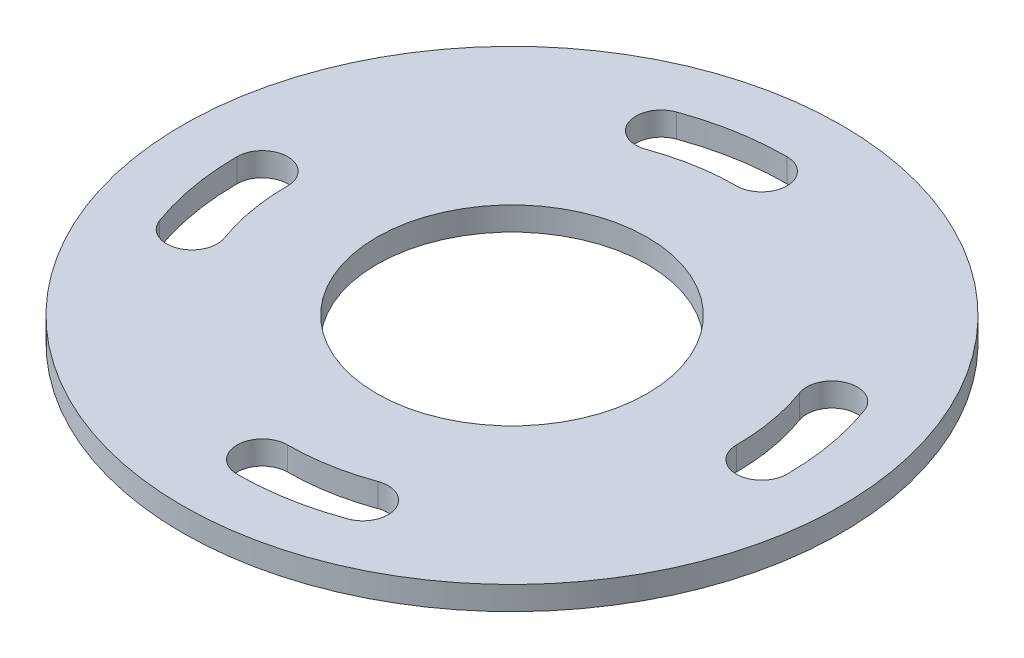
ISO-10303-21;
HEADER;
FILE_DESCRIPTION(('STEP AP214'),'2;1');
FILE_NAME('part.step','',(''),(''),'','','');
FILE_SCHEMA(('AUTOMOTIVE_DESIGN { 1 0 10303 214 1 1 1 1 }'));
ENDSEC;
DATA;
#1=APPLICATION_CONTEXT('core data for automotive mechanical design processes');
#2=APPLICATION_PROTOCOL_DEFINITION('international standard','automotive_design',2000,#1);
#3=PRODUCT_CONTEXT('',#1,'mechanical');
#4=PRODUCT('Part','Part','',(#3));
#5=PRODUCT_RELATED_PRODUCT_CATEGORY('part','',(#4));
#6=PRODUCT_DEFINITION_FORMATION('','',#4);
#7=PRODUCT_DEFINITION_CONTEXT('part definition',#1,'design');
#8=PRODUCT_DEFINITION('design','',#6,#7);
#9=PRODUCT_DEFINITION_SHAPE('','',#8);
#10=(LENGTH_UNIT() NAMED_UNIT(*) SI_UNIT(.MILLI.,.METRE.));
#11=(NAMED_UNIT(*) PLANE_ANGLE_UNIT() SI_UNIT($,.RADIAN.));
#12=(NAMED_UNIT(*) SI_UNIT($,.STERADIAN.) SOLID_ANGLE_UNIT());
#13=UNCERTAINTY_MEASURE_WITH_UNIT(LENGTH_MEASURE(1.E-05),#10,'distance_accuracy_value','');
#14=(GEOMETRIC_REPRESENTATION_CONTEXT(3) GLOBAL_UNCERTAINTY_ASSIGNED_CONTEXT((#13)) GLOBAL_UNIT_ASSIGNED_CONTEXT((#10,
#11,#12)) REPRESENTATION_CONTEXT('',''));
#15=CARTESIAN_POINT('',(0.,0.,0.));
#16=DIRECTION('',(0.,0.,1.));
#17=DIRECTION('',(1.,0.,0.));
#18=AXIS2_PLACEMENT_3D('',#15,#16,#17);
#19=CARTESIAN_POINT('',(0.,2.,0.));
#20=DIRECTION('',(0.,1.,0.));
#21=DIRECTION('',(0.,0.,1.));
#22=AXIS2_PLACEMENT_3D('',#19,#20,#21);
#23=PLANE('',#22);
#24=CARTESIAN_POINT('',(0.,2.,0.));
#25=DIRECTION('',(0.,1.,0.));
#26=DIRECTION('',(-1.,0.,0.));
#27=AXIS2_PLACEMENT_3D('',#24,#25,#26);
#28=CIRCLE('',#27,23.3632034355964);
#29=CARTESIAN_POINT('',(2.44584916902034E-13,2.,23.3632034355964));
#30=VERTEX_POINT('',#29);
#31=CARTESIAN_POINT('',(7.99068618758972,2.,21.9542298663498));
#32=VERTEX_POINT('',#31);
#33=EDGE_CURVE('E47',#30,#32,#28,.T.);
#34=ORIENTED_EDGE('',*,*,#33,.F.);
#35=CARTESIAN_POINT('',(2.22196511797404E-13,2.,21.2132034355964));
#36=DIRECTION('',(0.,1.,0.));
#37=DIRECTION('',(-1.,0.,0.));
#38=AXIS2_PLACEMENT_3D('',#35,#36,#37);
#39=CIRCLE('',#38,2.15);
#40=CARTESIAN_POINT('',(2.00071405754591E-13,2.,19.0632034355964));
#41=VERTEX_POINT('',#40);
#42=EDGE_CURVE('E163',#41,#30,#39,.T.);
#43=ORIENTED_EDGE('',*,*,#42,.F.);
#44=CARTESIAN_POINT('',(0.,2.,0.));
#45=DIRECTION('',(0.,-1.,0.));
#46=DIRECTION('',(-1.,0.,0.));
#47=AXIS2_PLACEMENT_3D('',#44,#45,#46);
#48=CIRCLE('',#47,19.0632034355964);
#49=CARTESIAN_POINT('',(6.5199995712893,2.,17.9135515969705));
#50=VERTEX_POINT('',#49);
#51=EDGE_CURVE('E166',#50,#41,#48,.T.);
#52=ORIENTED_EDGE('',*,*,#51,.F.);
#53=CARTESIAN_POINT('',(7.25534287943951,2.,19.9338907316602));
#54=DIRECTION('',(0.,1.,0.));
#55=DIRECTION('',(-1.,0.,0.));
#56=AXIS2_PLACEMENT_3D('',#53,#54,#55);
#57=CIRCLE('',#56,2.15);
#58=EDGE_CURVE('E172',#32,#50,#57,.T.);
#59=ORIENTED_EDGE('',*,*,#58,.F.);
#60=EDGE_LOOP('',(#34,#43,#52,#59));
#61=FACE_BOUND('',#60,.T.);
#62=CARTESIAN_POINT('',(0.,2.,0.));
#63=DIRECTION('',(0.,1.,0.));
#64=DIRECTION('',(0.,0.,-1.));
#65=AXIS2_PLACEMENT_3D('',#62,#63,#64);
#66=CIRCLE('',#65,23.3632034355964);
#67=CARTESIAN_POINT('',(-23.3632034355964,2.,0.));
#68=VERTEX_POINT('',#67);
#69=CARTESIAN_POINT('',(-21.9542298663499,2.,7.99068618758949));
#70=VERTEX_POINT('',#69);
#71=EDGE_CURVE('E178',#68,#70,#66,.T.);
#72=ORIENTED_EDGE('',*,*,#71,.F.);
#73=CARTESIAN_POINT('',(-21.2132034355964,2.,0.));
#74=DIRECTION('',(0.,1.,0.));
#75=DIRECTION('',(0.,0.,-1.));
#76=AXIS2_PLACEMENT_3D('',#73,#74,#75);
#77=CIRCLE('',#76,2.15);
#78=CARTESIAN_POINT('',(-19.0632034355964,2.,0.));
#79=VERTEX_POINT('',#78);
#80=EDGE_CURVE('E186',#79,#68,#77,.T.);
#81=ORIENTED_EDGE('',*,*,#80,.F.);
#82=CARTESIAN_POINT('',(0.,2.,0.));
#83=DIRECTION('',(0.,-1.,0.));
#84=DIRECTION('',(0.,0.,-1.));
#85=AXIS2_PLACEMENT_3D('',#82,#83,#84);
#86=CIRCLE('',#85,19.0632034355964);
#87=CARTESIAN_POINT('',(-17.9135515969705,2.,6.51999957128911));
#88=VERTEX_POINT('',#87);
#89=EDGE_CURVE('E200',#88,#79,#86,.T.);
#90=ORIENTED_EDGE('',*,*,#89,.F.);
#91=CARTESIAN_POINT('',(-19.9338907316602,2.,7.2553428794393));
#92=DIRECTION('',(0.,1.,0.));
#93=DIRECTION('',(0.,0.,-1.));
#94=AXIS2_PLACEMENT_3D('',#91,#92,#93);
#95=CIRCLE('',#94,2.15);
#96=EDGE_CURVE('E197',#70,#88,#95,.T.);
#97=ORIENTED_EDGE('',*,*,#96,.F.);
#98=EDGE_LOOP('',(#72,#81,#90,#97));
#99=FACE_BOUND('',#98,.T.);
#100=CARTESIAN_POINT('',(0.,2.,0.));
#101=DIRECTION('',(0.,1.,0.));
#102=DIRECTION('',(1.,0.,0.));
#103=AXIS2_PLACEMENT_3D('',#100,#101,#102);
#104=CIRCLE('',#103,23.3632034355964);
#105=CARTESIAN_POINT('',(0.,2.,-23.3632034355964));
#106=VERTEX_POINT('',#105);
#107=CARTESIAN_POINT('',(-7.99068618758957,2.,-21.9542298663499));
#108=VERTEX_POINT('',#107);
#109=EDGE_CURVE('E207',#106,#108,#104,.T.);
#110=ORIENTED_EDGE('',*,*,#109,.F.);
#111=CARTESIAN_POINT('',(0.,2.,-21.2132034355964));
#112=DIRECTION('',(0.,1.,0.));
#113=DIRECTION('',(1.,0.,0.));
#114=AXIS2_PLACEMENT_3D('',#111,#112,#113);
#115=CIRCLE('',#114,2.15);
#116=CARTESIAN_POINT('',(0.,2.,-19.0632034355964));
#117=VERTEX_POINT('',#116);
#118=EDGE_CURVE('E218',#117,#106,#115,.T.);
#119=ORIENTED_EDGE('',*,*,#118,.F.);
#120=CARTESIAN_POINT('',(0.,2.,0.));
#121=DIRECTION('',(0.,-1.,0.));
#122=DIRECTION('',(1.,0.,0.));
#123=AXIS2_PLACEMENT_3D('',#120,#121,#122);
#124=CIRCLE('',#123,19.0632034355964);
#125=CARTESIAN_POINT('',(-6.51999957128917,2.,-17.9135515969705));
#126=VERTEX_POINT('',#125);
#127=EDGE_CURVE('E232',#126,#117,#124,.T.);
#128=ORIENTED_EDGE('',*,*,#127,.F.);
#129=CARTESIAN_POINT('',(-7.25534287943937,2.,-19.9338907316602));
#130=DIRECTION('',(0.,1.,0.));
#131=DIRECTION('',(1.,0.,0.));
#132=AXIS2_PLACEMENT_3D('',#129,#130,#131);
#133=CIRCLE('',#132,2.15);
#134=EDGE_CURVE('E229',#108,#126,#133,.T.);
#135=ORIENTED_EDGE('',*,*,#134,.F.);
#136=EDGE_LOOP('',(#110,#119,#128,#135));
#137=FACE_BOUND('',#136,.T.);
#138=CARTESIAN_POINT('',(0.,2.,0.));
#139=DIRECTION('',(0.,1.,0.));
#140=DIRECTION('',(0.,0.,1.));
#141=AXIS2_PLACEMENT_3D('',#138,#139,#140);
#142=CIRCLE('',#141,23.3632034355964);
#143=CARTESIAN_POINT('',(23.3632034355964,2.,0.));
#144=VERTEX_POINT('',#143);
#145=CARTESIAN_POINT('',(21.9542298663499,2.,-7.99068618758949));
#146=VERTEX_POINT('',#145);
#147=EDGE_CURVE('E239',#144,#146,#142,.T.);
#148=ORIENTED_EDGE('',*,*,#147,.F.);
#149=CARTESIAN_POINT('',(21.2132034355964,2.,0.));
#150=DIRECTION('',(0.,1.,0.));
#151=DIRECTION('',(0.,0.,1.));
#152=AXIS2_PLACEMENT_3D('',#149,#150,#151);
#153=CIRCLE('',#152,2.15);
#154=CARTESIAN_POINT('',(19.0632034355964,2.,0.));
#155=VERTEX_POINT('',#154);
#156=EDGE_CURVE('E250',#155,#144,#153,.T.);
#157=ORIENTED_EDGE('',*,*,#156,.F.);
#158=CARTESIAN_POINT('',(0.,2.,0.));
#159=DIRECTION('',(0.,-1.,0.));
#160=DIRECTION('',(0.,0.,1.));
#161=AXIS2_PLACEMENT_3D('',#158,#159,#160);
#162=CIRCLE('',#161,19.0632034355964);
#163=CARTESIAN_POINT('',(17.9135515969705,2.,-6.51999957128911));
#164=VERTEX_POINT('',#163);
#165=EDGE_CURVE('E264',#164,#155,#162,.T.);
#166=ORIENTED_EDGE('',*,*,#165,.F.);
#167=CARTESIAN_POINT('',(19.9338907316602,2.,-7.2553428794393));
#168=DIRECTION('',(0.,1.,0.));
#169=DIRECTION('',(0.,0.,1.));
#170=AXIS2_PLACEMENT_3D('',#167,#168,#169);
#171=CIRCLE('',#170,2.15);
#172=EDGE_CURVE('E261',#146,#164,#171,.T.);
#173=ORIENTED_EDGE('',*,*,#172,.F.);
#174=EDGE_LOOP('',(#148,#157,#166,#173));
#175=FACE_BOUND('',#174,.T.);
#176=CARTESIAN_POINT('',(0.,2.,0.));
#177=DIRECTION('',(0.,1.,0.));
#178=DIRECTION('',(0.,0.,1.));
#179=AXIS2_PLACEMENT_3D('',#176,#177,#178);
#180=CIRCLE('',#179,28.);
#181=CARTESIAN_POINT('',(0.,2.,28.));
#182=VERTEX_POINT('',#181);
#183=EDGE_CURVE('E11',#182,#182,#180,.T.);
#184=ORIENTED_EDGE('',*,*,#183,.T.);
#185=EDGE_LOOP('',(#184));
#186=FACE_BOUND('',#185,.T.);
#187=CARTESIAN_POINT('',(0.,2.,0.));
#188=DIRECTION('',(0.,1.,0.));
#189=DIRECTION('',(0.,0.,1.));
#190=AXIS2_PLACEMENT_3D('',#187,#188,#189);
#191=CIRCLE('',#190,11.5);
#192=CARTESIAN_POINT('',(0.,2.,11.5));
#193=VERTEX_POINT('',#192);
#194=EDGE_CURVE('E278',#193,#193,#191,.T.);
#195=ORIENTED_EDGE('',*,*,#194,.F.);
#196=EDGE_LOOP('',(#195));
#197=FACE_BOUND('',#196,.T.);
#198=ADVANCED_FACE('F32',(#61,#99,#137,#175,#186,#197),#23,.T.);
#199=CARTESIAN_POINT('',(0.,0.,0.));
#200=DIRECTION('',(0.,1.,0.));
#201=DIRECTION('',(0.,0.,1.));
#202=AXIS2_PLACEMENT_3D('',#199,#200,#201);
#203=PLANE('',#202);
#204=CARTESIAN_POINT('',(2.22196511797404E-13,0.,21.2132034355964));
#205=DIRECTION('',(0.,1.,0.));
#206=DIRECTION('',(-1.,0.,0.));
#207=AXIS2_PLACEMENT_3D('',#204,#205,#206);
#208=CIRCLE('',#207,2.15);
#209=CARTESIAN_POINT('',(2.00071405754591E-13,0.,19.0632034355964));
#210=VERTEX_POINT('',#209);
#211=CARTESIAN_POINT('',(2.44584916902034E-13,0.,23.3632034355964));
#212=VERTEX_POINT('',#211);
#213=EDGE_CURVE('E153',#210,#212,#208,.T.);
#214=ORIENTED_EDGE('',*,*,#213,.T.);
#215=CARTESIAN_POINT('',(0.,0.,0.));
#216=DIRECTION('',(0.,1.,0.));
#217=DIRECTION('',(-1.,0.,0.));
#218=AXIS2_PLACEMENT_3D('',#215,#216,#217);
#219=CIRCLE('',#218,23.3632034355964);
#220=CARTESIAN_POINT('',(7.99068618758972,0.,21.9542298663498));
#221=VERTEX_POINT('',#220);
#222=EDGE_CURVE('E147',#212,#221,#219,.T.);
#223=ORIENTED_EDGE('',*,*,#222,.T.);
#224=CARTESIAN_POINT('',(7.25534287943951,0.,19.9338907316602));
#225=DIRECTION('',(0.,1.,0.));
#226=DIRECTION('',(-1.,0.,0.));
#227=AXIS2_PLACEMENT_3D('',#224,#225,#226);
#228=CIRCLE('',#227,2.15);
#229=CARTESIAN_POINT('',(6.5199995712893,0.,17.9135515969705));
#230=VERTEX_POINT('',#229);
#231=EDGE_CURVE('E156',#221,#230,#228,.T.);
#232=ORIENTED_EDGE('',*,*,#231,.T.);
#233=CARTESIAN_POINT('',(0.,0.,0.));
#234=DIRECTION('',(0.,-1.,0.));
#235=DIRECTION('',(-1.,0.,0.));
#236=AXIS2_PLACEMENT_3D('',#233,#234,#235);
#237=CIRCLE('',#236,19.0632034355964);
#238=EDGE_CURVE('E55',#230,#210,#237,.T.);
#239=ORIENTED_EDGE('',*,*,#238,.T.);
#240=EDGE_LOOP('',(#214,#223,#232,#239));
#241=FACE_BOUND('',#240,.T.);
#242=CARTESIAN_POINT('',(-21.2132034355964,0.,0.));
#243=DIRECTION('',(0.,1.,0.));
#244=DIRECTION('',(0.,0.,-1.));
#245=AXIS2_PLACEMENT_3D('',#242,#243,#244);
#246=CIRCLE('',#245,2.15);
#247=CARTESIAN_POINT('',(-19.0632034355964,0.,0.));
#248=VERTEX_POINT('',#247);
#249=CARTESIAN_POINT('',(-23.3632034355964,0.,0.));
#250=VERTEX_POINT('',#249);
#251=EDGE_CURVE('E192',#248,#250,#246,.T.);
#252=ORIENTED_EDGE('',*,*,#251,.T.);
#253=CARTESIAN_POINT('',(0.,0.,0.));
#254=DIRECTION('',(0.,1.,0.));
#255=DIRECTION('',(0.,0.,-1.));
#256=AXIS2_PLACEMENT_3D('',#253,#254,#255);
#257=CIRCLE('',#256,23.3632034355964);
#258=CARTESIAN_POINT('',(-21.9542298663499,0.,7.99068618758949));
#259=VERTEX_POINT('',#258);
#260=EDGE_CURVE('E182',#250,#259,#257,.T.);
#261=ORIENTED_EDGE('',*,*,#260,.T.);
#262=CARTESIAN_POINT('',(-19.9338907316602,0.,7.2553428794393));
#263=DIRECTION('',(0.,1.,0.));
#264=DIRECTION('',(0.,0.,-1.));
#265=AXIS2_PLACEMENT_3D('',#262,#263,#264);
#266=CIRCLE('',#265,2.15);
#267=CARTESIAN_POINT('',(-17.9135515969705,0.,6.51999957128911));
#268=VERTEX_POINT('',#267);
#269=EDGE_CURVE('E185',#259,#268,#266,.T.);
#270=ORIENTED_EDGE('',*,*,#269,.T.);
#271=CARTESIAN_POINT('',(0.,0.,0.));
#272=DIRECTION('',(0.,-1.,0.));
#273=DIRECTION('',(0.,0.,-1.));
#274=AXIS2_PLACEMENT_3D('',#271,#272,#273);
#275=CIRCLE('',#274,19.0632034355964);
#276=EDGE_CURVE('E189',#268,#248,#275,.T.);
#277=ORIENTED_EDGE('',*,*,#276,.T.);
#278=EDGE_LOOP('',(#252,#261,#270,#277));
#279=FACE_BOUND('',#278,.T.);
#280=CARTESIAN_POINT('',(0.,0.,-21.2132034355964));
#281=DIRECTION('',(0.,1.,0.));
#282=DIRECTION('',(1.,0.,0.));
#283=AXIS2_PLACEMENT_3D('',#280,#281,#282);
#284=CIRCLE('',#283,2.15);
#285=CARTESIAN_POINT('',(0.,0.,-19.0632034355964));
#286=VERTEX_POINT('',#285);
#287=CARTESIAN_POINT('',(0.,0.,-23.3632034355964));
#288=VERTEX_POINT('',#287);
#289=EDGE_CURVE('E224',#286,#288,#284,.T.);
#290=ORIENTED_EDGE('',*,*,#289,.T.);
#291=CARTESIAN_POINT('',(0.,0.,0.));
#292=DIRECTION('',(0.,1.,0.));
#293=DIRECTION('',(1.,0.,0.));
#294=AXIS2_PLACEMENT_3D('',#291,#292,#293);
#295=CIRCLE('',#294,23.3632034355964);
#296=CARTESIAN_POINT('',(-7.99068618758957,0.,-21.9542298663499));
#297=VERTEX_POINT('',#296);
#298=EDGE_CURVE('E214',#288,#297,#295,.T.);
#299=ORIENTED_EDGE('',*,*,#298,.T.);
#300=CARTESIAN_POINT('',(-7.25534287943937,0.,-19.9338907316602));
#301=DIRECTION('',(0.,1.,0.));
#302=DIRECTION('',(1.,0.,0.));
#303=AXIS2_PLACEMENT_3D('',#300,#301,#302);
#304=CIRCLE('',#303,2.15);
#305=CARTESIAN_POINT('',(-6.51999957128918,0.,-17.9135515969705));
#306=VERTEX_POINT('',#305);
#307=EDGE_CURVE('E217',#297,#306,#304,.T.);
#308=ORIENTED_EDGE('',*,*,#307,.T.);
#309=CARTESIAN_POINT('',(0.,0.,0.));
#310=DIRECTION('',(0.,-1.,0.));
#311=DIRECTION('',(1.,0.,0.));
#312=AXIS2_PLACEMENT_3D('',#309,#310,#311);
#313=CIRCLE('',#312,19.0632034355964);
#314=EDGE_CURVE('E221',#306,#286,#313,.T.);
#315=ORIENTED_EDGE('',*,*,#314,.T.);
#316=EDGE_LOOP('',(#290,#299,#308,#315));
#317=FACE_BOUND('',#316,.T.);
#318=CARTESIAN_POINT('',(21.2132034355964,0.,0.));
#319=DIRECTION('',(0.,1.,0.));
#320=DIRECTION('',(0.,0.,1.));
#321=AXIS2_PLACEMENT_3D('',#318,#319,#320);
#322=CIRCLE('',#321,2.15);
#323=CARTESIAN_POINT('',(19.0632034355964,0.,0.));
#324=VERTEX_POINT('',#323);
#325=CARTESIAN_POINT('',(23.3632034355964,0.,0.));
#326=VERTEX_POINT('',#325);
#327=EDGE_CURVE('E256',#324,#326,#322,.T.);
#328=ORIENTED_EDGE('',*,*,#327,.T.);
#329=CARTESIAN_POINT('',(0.,0.,0.));
#330=DIRECTION('',(0.,1.,0.));
#331=DIRECTION('',(0.,0.,1.));
#332=AXIS2_PLACEMENT_3D('',#329,#330,#331);
#333=CIRCLE('',#332,23.3632034355964);
#334=CARTESIAN_POINT('',(21.9542298663499,0.,-7.99068618758949));
#335=VERTEX_POINT('',#334);
#336=EDGE_CURVE('E246',#326,#335,#333,.T.);
#337=ORIENTED_EDGE('',*,*,#336,.T.);
#338=CARTESIAN_POINT('',(19.9338907316602,0.,-7.2553428794393));
#339=DIRECTION('',(0.,1.,0.));
#340=DIRECTION('',(0.,0.,1.));
#341=AXIS2_PLACEMENT_3D('',#338,#339,#340);
#342=CIRCLE('',#341,2.15);
#343=CARTESIAN_POINT('',(17.9135515969705,0.,-6.51999957128911));
#344=VERTEX_POINT('',#343);
#345=EDGE_CURVE('E249',#335,#344,#342,.T.);
#346=ORIENTED_EDGE('',*,*,#345,.T.);
#347=CARTESIAN_POINT('',(0.,0.,0.));
#348=DIRECTION('',(0.,-1.,0.));
#349=DIRECTION('',(0.,0.,1.));
#350=AXIS2_PLACEMENT_3D('',#347,#348,#349);
#351=CIRCLE('',#350,19.0632034355964);
#352=EDGE_CURVE('E253',#344,#324,#351,.T.);
#353=ORIENTED_EDGE('',*,*,#352,.T.);
#354=EDGE_LOOP('',(#328,#337,#346,#353));
#355=FACE_BOUND('',#354,.T.);
#356=CARTESIAN_POINT('',(0.,0.,0.));
#357=DIRECTION('',(0.,1.,0.));
#358=DIRECTION('',(0.,0.,1.));
#359=AXIS2_PLACEMENT_3D('',#356,#357,#358);
#360=CIRCLE('',#359,28.);
#361=CARTESIAN_POINT('',(0.,0.,28.));
#362=VERTEX_POINT('',#361);
#363=EDGE_CURVE('E36',#362,#362,#360,.T.);
#364=ORIENTED_EDGE('',*,*,#363,.F.);
#365=EDGE_LOOP('',(#364));
#366=FACE_BOUND('',#365,.T.);
#367=CARTESIAN_POINT('',(0.,0.,0.));
#368=DIRECTION('',(0.,1.,0.));
#369=DIRECTION('',(0.,0.,1.));
#370=AXIS2_PLACEMENT_3D('',#367,#368,#369);
#371=CIRCLE('',#370,11.5);
#372=CARTESIAN_POINT('',(0.,0.,11.5));
#373=VERTEX_POINT('',#372);
#374=EDGE_CURVE('E271',#373,#373,#371,.T.);
#375=ORIENTED_EDGE('',*,*,#374,.T.);
#376=EDGE_LOOP('',(#375));
#377=FACE_BOUND('',#376,.T.);
#378=ADVANCED_FACE('F160',(#241,#279,#317,#355,#366,#377),#203,.F.);
#379=CARTESIAN_POINT('',(0.,2.,0.));
#380=DIRECTION('',(0.,-1.,0.));
#381=DIRECTION('',(0.,0.,-1.));
#382=AXIS2_PLACEMENT_3D('',#379,#380,#381);
#383=CYLINDRICAL_SURFACE('',#382,28.);
#384=ORIENTED_EDGE('',*,*,#183,.F.);
#385=EDGE_LOOP('',(#384));
#386=FACE_BOUND('',#385,.T.);
#387=ORIENTED_EDGE('',*,*,#363,.T.);
#388=EDGE_LOOP('',(#387));
#389=FACE_BOUND('',#388,.T.);
#390=ADVANCED_FACE('F34',(#386,#389),#383,.T.);
#391=CARTESIAN_POINT('',(0.,2.,0.));
#392=DIRECTION('',(0.,-1.,0.));
#393=DIRECTION('',(0.,0.,-1.));
#394=AXIS2_PLACEMENT_3D('',#391,#392,#393);
#395=CYLINDRICAL_SURFACE('',#394,11.5);
#396=ORIENTED_EDGE('',*,*,#194,.T.);
#397=EDGE_LOOP('',(#396));
#398=FACE_BOUND('',#397,.T.);
#399=ORIENTED_EDGE('',*,*,#374,.F.);
#400=EDGE_LOOP('',(#399));
#401=FACE_BOUND('',#400,.T.);
#402=ADVANCED_FACE('F285',(#398,#401),#395,.F.);
#403=CARTESIAN_POINT('',(0.,0.,0.));
#404=DIRECTION('',(0.,1.,0.));
#405=DIRECTION('',(0.,0.,1.));
#406=AXIS2_PLACEMENT_3D('',#403,#404,#405);
#407=CYLINDRICAL_SURFACE('',#406,23.3632034355964);
#408=ORIENTED_EDGE('',*,*,#147,.T.);
#409=DIRECTION('',(0.,1.,0.));
#410=VECTOR('',#409,1.);
#411=CARTESIAN_POINT('',(21.9542298663499,0.,-7.99068618758949));
#412=LINE('',#411,#410);
#413=EDGE_CURVE('E259',#335,#146,#412,.T.);
#414=ORIENTED_EDGE('',*,*,#413,.F.);
#415=ORIENTED_EDGE('',*,*,#336,.F.);
#416=DIRECTION('',(0.,1.,0.));
#417=VECTOR('',#416,1.);
#418=CARTESIAN_POINT('',(23.3632034355964,0.,0.));
#419=LINE('',#418,#417);
#420=EDGE_CURVE('E269',#326,#144,#419,.T.);
#421=ORIENTED_EDGE('',*,*,#420,.T.);
#422=EDGE_LOOP('',(#408,#414,#415,#421));
#423=FACE_BOUND('',#422,.T.);
#424=ADVANCED_FACE('F287',(#423),#407,.F.);
#425=CARTESIAN_POINT('',(21.2132034355964,0.,0.));
#426=DIRECTION('',(0.,1.,0.));
#427=DIRECTION('',(0.,0.,1.));
#428=AXIS2_PLACEMENT_3D('',#425,#426,#427);
#429=CYLINDRICAL_SURFACE('',#428,2.15);
#430=ORIENTED_EDGE('',*,*,#156,.T.);
#431=ORIENTED_EDGE('',*,*,#420,.F.);
#432=ORIENTED_EDGE('',*,*,#327,.F.);
#433=DIRECTION('',(0.,1.,0.));
#434=VECTOR('',#433,1.);
#435=CARTESIAN_POINT('',(19.0632034355964,0.,0.));
#436=LINE('',#435,#434);
#437=EDGE_CURVE('E272',#324,#155,#436,.T.);
#438=ORIENTED_EDGE('',*,*,#437,.T.);
#439=EDGE_LOOP('',(#430,#431,#432,#438));
#440=FACE_BOUND('',#439,.T.);
#441=ADVANCED_FACE('F294',(#440),#429,.F.);
#442=CARTESIAN_POINT('',(0.,0.,0.));
#443=DIRECTION('',(0.,1.,0.));
#444=DIRECTION('',(0.,0.,1.));
#445=AXIS2_PLACEMENT_3D('',#442,#443,#444);
#446=CYLINDRICAL_SURFACE('',#445,19.0632034355964);
#447=ORIENTED_EDGE('',*,*,#165,.T.);
#448=ORIENTED_EDGE('',*,*,#437,.F.);
#449=ORIENTED_EDGE('',*,*,#352,.F.);
#450=DIRECTION('',(0.,1.,0.));
#451=VECTOR('',#450,1.);
#452=CARTESIAN_POINT('',(17.9135515969705,0.,-6.51999957128911));
#453=LINE('',#452,#451);
#454=EDGE_CURVE('E274',#344,#164,#453,.T.);
#455=ORIENTED_EDGE('',*,*,#454,.T.);
#456=EDGE_LOOP('',(#447,#448,#449,#455));
#457=FACE_BOUND('',#456,.T.);
#458=ADVANCED_FACE('F335',(#457),#446,.T.);
#459=CARTESIAN_POINT('',(19.9338907316602,0.,-7.2553428794393));
#460=DIRECTION('',(0.,1.,0.));
#461=DIRECTION('',(0.,0.,1.));
#462=AXIS2_PLACEMENT_3D('',#459,#460,#461);
#463=CYLINDRICAL_SURFACE('',#462,2.15);
#464=ORIENTED_EDGE('',*,*,#172,.T.);
#465=ORIENTED_EDGE('',*,*,#454,.F.);
#466=ORIENTED_EDGE('',*,*,#345,.F.);
#467=ORIENTED_EDGE('',*,*,#413,.T.);
#468=EDGE_LOOP('',(#464,#465,#466,#467));
#469=FACE_BOUND('',#468,.T.);
#470=ADVANCED_FACE('F329',(#469),#463,.F.);
#471=CARTESIAN_POINT('',(0.,0.,0.));
#472=DIRECTION('',(0.,1.,0.));
#473=DIRECTION('',(0.,0.,1.));
#474=AXIS2_PLACEMENT_3D('',#471,#472,#473);
#475=CYLINDRICAL_SURFACE('',#474,23.3632034355964);
#476=ORIENTED_EDGE('',*,*,#109,.T.);
#477=DIRECTION('',(0.,1.,0.));
#478=VECTOR('',#477,1.);
#479=CARTESIAN_POINT('',(-7.99068618758957,0.,-21.9542298663499));
#480=LINE('',#479,#478);
#481=EDGE_CURVE('E227',#297,#108,#480,.T.);
#482=ORIENTED_EDGE('',*,*,#481,.F.);
#483=ORIENTED_EDGE('',*,*,#298,.F.);
#484=DIRECTION('',(0.,1.,0.));
#485=VECTOR('',#484,1.);
#486=CARTESIAN_POINT('',(0.,0.,-23.3632034355964));
#487=LINE('',#486,#485);
#488=EDGE_CURVE('E237',#288,#106,#487,.T.);
#489=ORIENTED_EDGE('',*,*,#488,.T.);
#490=EDGE_LOOP('',(#476,#482,#483,#489));
#491=FACE_BOUND('',#490,.T.);
#492=ADVANCED_FACE('F342',(#491),#475,.F.);
#493=CARTESIAN_POINT('',(0.,0.,-21.2132034355964));
#494=DIRECTION('',(0.,1.,0.));
#495=DIRECTION('',(0.,0.,1.));
#496=AXIS2_PLACEMENT_3D('',#493,#494,#495);
#497=CYLINDRICAL_SURFACE('',#496,2.15);
#498=ORIENTED_EDGE('',*,*,#118,.T.);
#499=ORIENTED_EDGE('',*,*,#488,.F.);
#500=ORIENTED_EDGE('',*,*,#289,.F.);
#501=DIRECTION('',(0.,1.,0.));
#502=VECTOR('',#501,1.);
#503=CARTESIAN_POINT('',(0.,0.,-19.0632034355964));
#504=LINE('',#503,#502);
#505=EDGE_CURVE('E240',#286,#117,#504,.T.);
#506=ORIENTED_EDGE('',*,*,#505,.T.);
#507=EDGE_LOOP('',(#498,#499,#500,#506));
#508=FACE_BOUND('',#507,.T.);
#509=ADVANCED_FACE('F348',(#508),#497,.F.);
#510=CARTESIAN_POINT('',(0.,0.,0.));
#511=DIRECTION('',(0.,1.,0.));
#512=DIRECTION('',(0.,0.,1.));
#513=AXIS2_PLACEMENT_3D('',#510,#511,#512);
#514=CYLINDRICAL_SURFACE('',#513,19.0632034355964);
#515=ORIENTED_EDGE('',*,*,#127,.T.);
#516=ORIENTED_EDGE('',*,*,#505,.F.);
#517=ORIENTED_EDGE('',*,*,#314,.F.);
#518=DIRECTION('',(0.,1.,0.));
#519=VECTOR('',#518,1.);
#520=CARTESIAN_POINT('',(-6.51999957128917,0.,-17.9135515969705));
#521=LINE('',#520,#519);
#522=EDGE_CURVE('E242',#306,#126,#521,.T.);
#523=ORIENTED_EDGE('',*,*,#522,.T.);
#524=EDGE_LOOP('',(#515,#516,#517,#523));
#525=FACE_BOUND('',#524,.T.);
#526=ADVANCED_FACE('F354',(#525),#514,.T.);
#527=CARTESIAN_POINT('',(-7.25534287943937,0.,-19.9338907316602));
#528=DIRECTION('',(0.,1.,0.));
#529=DIRECTION('',(0.,0.,1.));
#530=AXIS2_PLACEMENT_3D('',#527,#528,#529);
#531=CYLINDRICAL_SURFACE('',#530,2.15);
#532=ORIENTED_EDGE('',*,*,#134,.T.);
#533=ORIENTED_EDGE('',*,*,#522,.F.);
#534=ORIENTED_EDGE('',*,*,#307,.F.);
#535=ORIENTED_EDGE('',*,*,#481,.T.);
#536=EDGE_LOOP('',(#532,#533,#534,#535));
#537=FACE_BOUND('',#536,.T.);
#538=ADVANCED_FACE('F350',(#537),#531,.F.);
#539=CARTESIAN_POINT('',(0.,0.,0.));
#540=DIRECTION('',(0.,1.,0.));
#541=DIRECTION('',(0.,0.,1.));
#542=AXIS2_PLACEMENT_3D('',#539,#540,#541);
#543=CYLINDRICAL_SURFACE('',#542,23.3632034355964);
#544=ORIENTED_EDGE('',*,*,#71,.T.);
#545=DIRECTION('',(0.,1.,0.));
#546=VECTOR('',#545,1.);
#547=CARTESIAN_POINT('',(-21.9542298663499,0.,7.99068618758949));
#548=LINE('',#547,#546);
#549=EDGE_CURVE('E195',#259,#70,#548,.T.);
#550=ORIENTED_EDGE('',*,*,#549,.F.);
#551=ORIENTED_EDGE('',*,*,#260,.F.);
#552=DIRECTION('',(0.,1.,0.));
#553=VECTOR('',#552,1.);
#554=CARTESIAN_POINT('',(-23.3632034355964,0.,0.));
#555=LINE('',#554,#553);
#556=EDGE_CURVE('E205',#250,#68,#555,.T.);
#557=ORIENTED_EDGE('',*,*,#556,.T.);
#558=EDGE_LOOP('',(#544,#550,#551,#557));
#559=FACE_BOUND('',#558,.T.);
#560=ADVANCED_FACE('F353',(#559),#543,.F.);
#561=CARTESIAN_POINT('',(-21.2132034355964,0.,0.));
#562=DIRECTION('',(0.,1.,0.));
#563=DIRECTION('',(0.,0.,1.));
#564=AXIS2_PLACEMENT_3D('',#561,#562,#563);
#565=CYLINDRICAL_SURFACE('',#564,2.15);
#566=ORIENTED_EDGE('',*,*,#80,.T.);
#567=ORIENTED_EDGE('',*,*,#556,.F.);
#568=ORIENTED_EDGE('',*,*,#251,.F.);
#569=DIRECTION('',(0.,1.,0.));
#570=VECTOR('',#569,1.);
#571=CARTESIAN_POINT('',(-19.0632034355964,0.,0.));
#572=LINE('',#571,#570);
#573=EDGE_CURVE('E208',#248,#79,#572,.T.);
#574=ORIENTED_EDGE('',*,*,#573,.T.);
#575=EDGE_LOOP('',(#566,#567,#568,#574));
#576=FACE_BOUND('',#575,.T.);
#577=ADVANCED_FACE('F364',(#576),#565,.F.);
#578=CARTESIAN_POINT('',(0.,0.,0.));
#579=DIRECTION('',(0.,1.,0.));
#580=DIRECTION('',(0.,0.,1.));
#581=AXIS2_PLACEMENT_3D('',#578,#579,#580);
#582=CYLINDRICAL_SURFACE('',#581,19.0632034355964);
#583=ORIENTED_EDGE('',*,*,#89,.T.);
#584=ORIENTED_EDGE('',*,*,#573,.F.);
#585=ORIENTED_EDGE('',*,*,#276,.F.);
#586=DIRECTION('',(0.,1.,0.));
#587=VECTOR('',#586,1.);
#588=CARTESIAN_POINT('',(-17.9135515969705,0.,6.51999957128911));
#589=LINE('',#588,#587);
#590=EDGE_CURVE('E210',#268,#88,#589,.T.);
#591=ORIENTED_EDGE('',*,*,#590,.T.);
#592=EDGE_LOOP('',(#583,#584,#585,#591));
#593=FACE_BOUND('',#592,.T.);
#594=ADVANCED_FACE('F369',(#593),#582,.T.);
#595=CARTESIAN_POINT('',(-19.9338907316602,0.,7.2553428794393));
#596=DIRECTION('',(0.,1.,0.));
#597=DIRECTION('',(0.,0.,1.));
#598=AXIS2_PLACEMENT_3D('',#595,#596,#597);
#599=CYLINDRICAL_SURFACE('',#598,2.15);
#600=ORIENTED_EDGE('',*,*,#96,.T.);
#601=ORIENTED_EDGE('',*,*,#590,.F.);
#602=ORIENTED_EDGE('',*,*,#269,.F.);
#603=ORIENTED_EDGE('',*,*,#549,.T.);
#604=EDGE_LOOP('',(#600,#601,#602,#603));
#605=FACE_BOUND('',#604,.T.);
#606=ADVANCED_FACE('F366',(#605),#599,.F.);
#607=CARTESIAN_POINT('',(0.,0.,0.));
#608=DIRECTION('',(0.,1.,0.));
#609=DIRECTION('',(0.,0.,1.));
#610=AXIS2_PLACEMENT_3D('',#607,#608,#609);
#611=CYLINDRICAL_SURFACE('',#610,23.3632034355964);
#612=ORIENTED_EDGE('',*,*,#33,.T.);
#613=DIRECTION('',(0.,1.,0.));
#614=VECTOR('',#613,1.);
#615=CARTESIAN_POINT('',(7.99068618758972,0.,21.9542298663498));
#616=LINE('',#615,#614);
#617=EDGE_CURVE('E143',#221,#32,#616,.T.);
#618=ORIENTED_EDGE('',*,*,#617,.F.);
#619=ORIENTED_EDGE('',*,*,#222,.F.);
#620=DIRECTION('',(0.,1.,0.));
#621=VECTOR('',#620,1.);
#622=CARTESIAN_POINT('',(2.44584916902034E-13,0.,23.3632034355964));
#623=LINE('',#622,#621);
#624=EDGE_CURVE('E176',#212,#30,#623,.T.);
#625=ORIENTED_EDGE('',*,*,#624,.T.);
#626=EDGE_LOOP('',(#612,#618,#619,#625));
#627=FACE_BOUND('',#626,.T.);
#628=ADVANCED_FACE('F145',(#627),#611,.F.);
#629=CARTESIAN_POINT('',(2.22196511797404E-13,0.,21.2132034355964));
#630=DIRECTION('',(0.,1.,0.));
#631=DIRECTION('',(0.,0.,1.));
#632=AXIS2_PLACEMENT_3D('',#629,#630,#631);
#633=CYLINDRICAL_SURFACE('',#632,2.15);
#634=ORIENTED_EDGE('',*,*,#42,.T.);
#635=ORIENTED_EDGE('',*,*,#624,.F.);
#636=ORIENTED_EDGE('',*,*,#213,.F.);
#637=DIRECTION('',(0.,1.,0.));
#638=VECTOR('',#637,1.);
#639=CARTESIAN_POINT('',(2.00071405754591E-13,0.,19.0632034355964));
#640=LINE('',#639,#638);
#641=EDGE_CURVE('E179',#210,#41,#640,.T.);
#642=ORIENTED_EDGE('',*,*,#641,.T.);
#643=EDGE_LOOP('',(#634,#635,#636,#642));
#644=FACE_BOUND('',#643,.T.);
#645=ADVANCED_FACE('F379',(#644),#633,.F.);
#646=CARTESIAN_POINT('',(0.,0.,0.));
#647=DIRECTION('',(0.,1.,0.));
#648=DIRECTION('',(0.,0.,1.));
#649=AXIS2_PLACEMENT_3D('',#646,#647,#648);
#650=CYLINDRICAL_SURFACE('',#649,19.0632034355964);
#651=ORIENTED_EDGE('',*,*,#51,.T.);
#652=ORIENTED_EDGE('',*,*,#641,.F.);
#653=ORIENTED_EDGE('',*,*,#238,.F.);
#654=DIRECTION('',(0.,1.,0.));
#655=VECTOR('',#654,1.);
#656=CARTESIAN_POINT('',(6.5199995712893,0.,17.9135515969705));
#657=LINE('',#656,#655);
#658=EDGE_CURVE('E152',#230,#50,#657,.T.);
#659=ORIENTED_EDGE('',*,*,#658,.T.);
#660=EDGE_LOOP('',(#651,#652,#653,#659));
#661=FACE_BOUND('',#660,.T.);
#662=ADVANCED_FACE('F382',(#661),#650,.T.);
#663=CARTESIAN_POINT('',(7.25534287943951,0.,19.9338907316602));
#664=DIRECTION('',(0.,1.,0.));
#665=DIRECTION('',(0.,0.,1.));
#666=AXIS2_PLACEMENT_3D('',#663,#664,#665);
#667=CYLINDRICAL_SURFACE('',#666,2.15);
#668=ORIENTED_EDGE('',*,*,#58,.T.);
#669=ORIENTED_EDGE('',*,*,#658,.F.);
#670=ORIENTED_EDGE('',*,*,#231,.F.);
#671=ORIENTED_EDGE('',*,*,#617,.T.);
#672=EDGE_LOOP('',(#668,#669,#670,#671));
#673=FACE_BOUND('',#672,.T.);
#674=ADVANCED_FACE('F157',(#673),#667,.F.);
#675=CLOSED_SHELL('',(#198,#378,#390,#402,#424,#441,#458,#470,#492,#509,#526,#538,#560,#577,
#594,#606,#628,#645,#662,#674));
#676=MANIFOLD_SOLID_BREP('B2',#675);
#677=ADVANCED_BREP_SHAPE_REPRESENTATION('',(#18,#676),#14);
#678=SHAPE_DEFINITION_REPRESENTATION(#9,#677);
ENDSEC;
END-ISO-10303-21;
